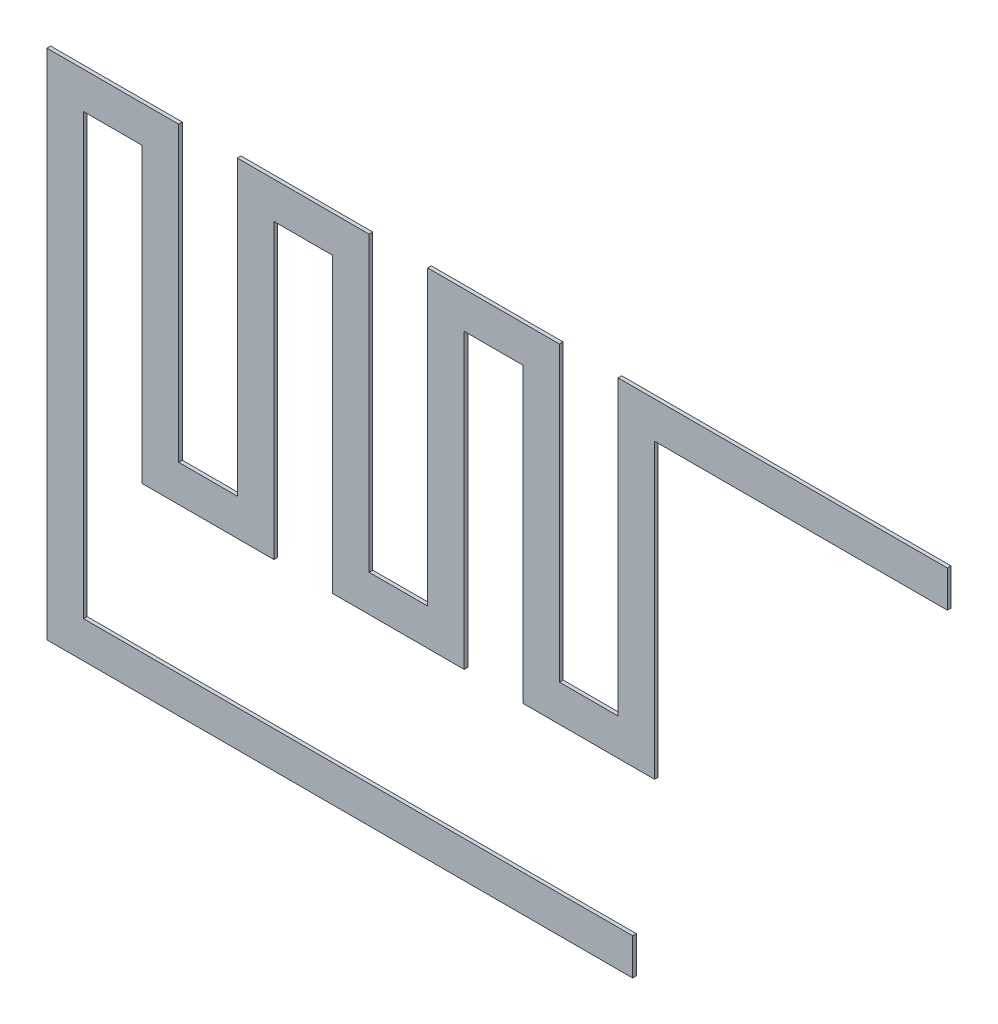
ISO-10303-21;
HEADER;
FILE_DESCRIPTION(('STEP AP214'),'2;1');
FILE_NAME('part.step','',(''),(''),'','','');
FILE_SCHEMA(('AUTOMOTIVE_DESIGN { 1 0 10303 214 1 1 1 1 }'));
ENDSEC;
DATA;
#1=APPLICATION_CONTEXT('core data for automotive mechanical design processes');
#2=APPLICATION_PROTOCOL_DEFINITION('international standard','automotive_design',2000,#1);
#3=PRODUCT_CONTEXT('',#1,'mechanical');
#4=PRODUCT('Part','Part','',(#3));
#5=PRODUCT_RELATED_PRODUCT_CATEGORY('part','',(#4));
#6=PRODUCT_DEFINITION_FORMATION('','',#4);
#7=PRODUCT_DEFINITION_CONTEXT('part definition',#1,'design');
#8=PRODUCT_DEFINITION('design','',#6,#7);
#9=PRODUCT_DEFINITION_SHAPE('','',#8);
#10=(LENGTH_UNIT() NAMED_UNIT(*) SI_UNIT(.MILLI.,.METRE.));
#11=(NAMED_UNIT(*) PLANE_ANGLE_UNIT() SI_UNIT($,.RADIAN.));
#12=(NAMED_UNIT(*) SI_UNIT($,.STERADIAN.) SOLID_ANGLE_UNIT());
#13=UNCERTAINTY_MEASURE_WITH_UNIT(LENGTH_MEASURE(1.E-05),#10,'distance_accuracy_value','');
#14=(GEOMETRIC_REPRESENTATION_CONTEXT(3) GLOBAL_UNCERTAINTY_ASSIGNED_CONTEXT((#13)) GLOBAL_UNIT_ASSIGNED_CONTEXT((#10,
#11,#12)) REPRESENTATION_CONTEXT('',''));
#15=CARTESIAN_POINT('',(0.,0.,0.));
#16=DIRECTION('',(0.,0.,1.));
#17=DIRECTION('',(1.,0.,0.));
#18=AXIS2_PLACEMENT_3D('',#15,#16,#17);
#19=CARTESIAN_POINT('',(4.513681102362,4.058562992126,0.025));
#20=DIRECTION('',(0.,0.,1.));
#21=DIRECTION('',(1.,0.,0.));
#22=AXIS2_PLACEMENT_3D('',#19,#20,#21);
#23=PLANE('',#22);
#24=DIRECTION('',(1.,0.,0.));
#25=VECTOR('',#24,1.);
#26=CARTESIAN_POINT('',(2.6,3.,0.025));
#27=LINE('',#26,#25);
#28=CARTESIAN_POINT('',(1.8,3.,0.025));
#29=VERTEX_POINT('',#28);
#30=CARTESIAN_POINT('',(2.6,3.,0.025));
#31=VERTEX_POINT('',#30);
#32=EDGE_CURVE('E525',#29,#31,#27,.T.);
#33=ORIENTED_EDGE('',*,*,#32,.F.);
#34=DIRECTION('',(0.,-1.,0.));
#35=VECTOR('',#34,1.);
#36=CARTESIAN_POINT('',(1.8,3.,0.025));
#37=LINE('',#36,#35);
#38=CARTESIAN_POINT('',(1.8,7.,0.025));
#39=VERTEX_POINT('',#38);
#40=EDGE_CURVE('E254',#39,#29,#37,.T.);
#41=ORIENTED_EDGE('',*,*,#40,.F.);
#42=DIRECTION('',(1.,0.,0.));
#43=VECTOR('',#42,1.);
#44=CARTESIAN_POINT('',(1.8,7.,0.025));
#45=LINE('',#44,#43);
#46=CARTESIAN_POINT('',(0.,7.,0.025));
#47=VERTEX_POINT('',#46);
#48=EDGE_CURVE('E188',#47,#39,#45,.T.);
#49=ORIENTED_EDGE('',*,*,#48,.F.);
#50=DIRECTION('',(0.,1.,0.));
#51=VECTOR('',#50,1.);
#52=CARTESIAN_POINT('',(0.,7.,0.025));
#53=LINE('',#52,#51);
#54=CARTESIAN_POINT('',(0.,0.,0.025));
#55=VERTEX_POINT('',#54);
#56=EDGE_CURVE('E185',#55,#47,#53,.T.);
#57=ORIENTED_EDGE('',*,*,#56,.F.);
#58=DIRECTION('',(-1.,0.,0.));
#59=VECTOR('',#58,1.);
#60=CARTESIAN_POINT('',(0.,0.,0.025));
#61=LINE('',#60,#59);
#62=CARTESIAN_POINT('',(8.,0.,0.025));
#63=VERTEX_POINT('',#62);
#64=EDGE_CURVE('E171',#63,#55,#61,.T.);
#65=ORIENTED_EDGE('',*,*,#64,.F.);
#66=DIRECTION('',(0.,-1.,0.));
#67=VECTOR('',#66,1.);
#68=CARTESIAN_POINT('',(8.,0.,0.025));
#69=LINE('',#68,#67);
#70=CARTESIAN_POINT('',(8.,0.5,0.025));
#71=VERTEX_POINT('',#70);
#72=EDGE_CURVE('E28',#71,#63,#69,.T.);
#73=ORIENTED_EDGE('',*,*,#72,.F.);
#74=DIRECTION('',(1.,0.,0.));
#75=VECTOR('',#74,1.);
#76=CARTESIAN_POINT('',(8.,0.5,0.025));
#77=LINE('',#76,#75);
#78=CARTESIAN_POINT('',(0.5,0.5,0.025));
#79=VERTEX_POINT('',#78);
#80=EDGE_CURVE('E11',#79,#71,#77,.T.);
#81=ORIENTED_EDGE('',*,*,#80,.F.);
#82=DIRECTION('',(0.,-1.,0.));
#83=VECTOR('',#82,1.);
#84=CARTESIAN_POINT('',(0.5,0.5,0.025));
#85=LINE('',#84,#83);
#86=CARTESIAN_POINT('',(0.5,6.5,0.025));
#87=VERTEX_POINT('',#86);
#88=EDGE_CURVE('E526',#87,#79,#85,.T.);
#89=ORIENTED_EDGE('',*,*,#88,.F.);
#90=DIRECTION('',(-1.,0.,0.));
#91=VECTOR('',#90,1.);
#92=CARTESIAN_POINT('',(0.5,6.5,0.025));
#93=LINE('',#92,#91);
#94=CARTESIAN_POINT('',(1.3,6.5,0.025));
#95=VERTEX_POINT('',#94);
#96=EDGE_CURVE('E535',#95,#87,#93,.T.);
#97=ORIENTED_EDGE('',*,*,#96,.F.);
#98=DIRECTION('',(0.,1.,0.));
#99=VECTOR('',#98,1.);
#100=CARTESIAN_POINT('',(1.3,6.5,0.025));
#101=LINE('',#100,#99);
#102=CARTESIAN_POINT('',(1.3,2.5,0.025));
#103=VERTEX_POINT('',#102);
#104=EDGE_CURVE('E493',#103,#95,#101,.T.);
#105=ORIENTED_EDGE('',*,*,#104,.F.);
#106=DIRECTION('',(-1.,0.,0.));
#107=VECTOR('',#106,1.);
#108=CARTESIAN_POINT('',(1.3,2.5,0.025));
#109=LINE('',#108,#107);
#110=CARTESIAN_POINT('',(3.1,2.5,0.025));
#111=VERTEX_POINT('',#110);
#112=EDGE_CURVE('E492',#111,#103,#109,.T.);
#113=ORIENTED_EDGE('',*,*,#112,.F.);
#114=DIRECTION('',(0.,-1.,0.));
#115=VECTOR('',#114,1.);
#116=CARTESIAN_POINT('',(3.1,2.5,0.025));
#117=LINE('',#116,#115);
#118=CARTESIAN_POINT('',(3.1,6.5,0.025));
#119=VERTEX_POINT('',#118);
#120=EDGE_CURVE('E458',#119,#111,#117,.T.);
#121=ORIENTED_EDGE('',*,*,#120,.F.);
#122=DIRECTION('',(-1.,0.,0.));
#123=VECTOR('',#122,1.);
#124=CARTESIAN_POINT('',(3.1,6.5,0.025));
#125=LINE('',#124,#123);
#126=CARTESIAN_POINT('',(3.9,6.5,0.025));
#127=VERTEX_POINT('',#126);
#128=EDGE_CURVE('E549',#127,#119,#125,.T.);
#129=ORIENTED_EDGE('',*,*,#128,.F.);
#130=DIRECTION('',(0.,1.,0.));
#131=VECTOR('',#130,1.);
#132=CARTESIAN_POINT('',(3.9,6.5,0.025));
#133=LINE('',#132,#131);
#134=CARTESIAN_POINT('',(3.9,2.5,0.025));
#135=VERTEX_POINT('',#134);
#136=EDGE_CURVE('E498',#135,#127,#133,.T.);
#137=ORIENTED_EDGE('',*,*,#136,.F.);
#138=DIRECTION('',(-1.,0.,0.));
#139=VECTOR('',#138,1.);
#140=CARTESIAN_POINT('',(3.9,2.5,0.025));
#141=LINE('',#140,#139);
#142=CARTESIAN_POINT('',(5.7,2.5,0.025));
#143=VERTEX_POINT('',#142);
#144=EDGE_CURVE('E555',#143,#135,#141,.T.);
#145=ORIENTED_EDGE('',*,*,#144,.F.);
#146=DIRECTION('',(0.,-1.,0.));
#147=VECTOR('',#146,1.);
#148=CARTESIAN_POINT('',(5.7,2.5,0.025));
#149=LINE('',#148,#147);
#150=CARTESIAN_POINT('',(5.7,6.5,0.025));
#151=VERTEX_POINT('',#150);
#152=EDGE_CURVE('E560',#151,#143,#149,.T.);
#153=ORIENTED_EDGE('',*,*,#152,.F.);
#154=DIRECTION('',(-1.,0.,0.));
#155=VECTOR('',#154,1.);
#156=CARTESIAN_POINT('',(5.7,6.5,0.025));
#157=LINE('',#156,#155);
#158=CARTESIAN_POINT('',(6.5,6.5,0.025));
#159=VERTEX_POINT('',#158);
#160=EDGE_CURVE('E568',#159,#151,#157,.T.);
#161=ORIENTED_EDGE('',*,*,#160,.F.);
#162=DIRECTION('',(0.,1.,0.));
#163=VECTOR('',#162,1.);
#164=CARTESIAN_POINT('',(6.5,6.5,0.025));
#165=LINE('',#164,#163);
#166=CARTESIAN_POINT('',(6.5,2.5,0.025));
#167=VERTEX_POINT('',#166);
#168=EDGE_CURVE('E424',#167,#159,#165,.T.);
#169=ORIENTED_EDGE('',*,*,#168,.F.);
#170=DIRECTION('',(-1.,0.,0.));
#171=VECTOR('',#170,1.);
#172=CARTESIAN_POINT('',(6.5,2.5,0.025));
#173=LINE('',#172,#171);
#174=CARTESIAN_POINT('',(8.3,2.5,0.025));
#175=VERTEX_POINT('',#174);
#176=EDGE_CURVE('E430',#175,#167,#173,.T.);
#177=ORIENTED_EDGE('',*,*,#176,.F.);
#178=DIRECTION('',(0.,-1.,0.));
#179=VECTOR('',#178,1.);
#180=CARTESIAN_POINT('',(8.3,2.5,0.025));
#181=LINE('',#180,#179);
#182=CARTESIAN_POINT('',(8.3,6.5,0.025));
#183=VERTEX_POINT('',#182);
#184=EDGE_CURVE('E429',#183,#175,#181,.T.);
#185=ORIENTED_EDGE('',*,*,#184,.F.);
#186=DIRECTION('',(-1.,0.,0.));
#187=VECTOR('',#186,1.);
#188=CARTESIAN_POINT('',(8.3,6.5,0.025));
#189=LINE('',#188,#187);
#190=CARTESIAN_POINT('',(12.3,6.5,0.025));
#191=VERTEX_POINT('',#190);
#192=EDGE_CURVE('E383',#191,#183,#189,.T.);
#193=ORIENTED_EDGE('',*,*,#192,.F.);
#194=DIRECTION('',(0.,-1.,0.));
#195=VECTOR('',#194,1.);
#196=CARTESIAN_POINT('',(12.3,6.5,0.025));
#197=LINE('',#196,#195);
#198=CARTESIAN_POINT('',(12.3,7.,0.025));
#199=VERTEX_POINT('',#198);
#200=EDGE_CURVE('E381',#199,#191,#197,.T.);
#201=ORIENTED_EDGE('',*,*,#200,.F.);
#202=DIRECTION('',(1.,0.,0.));
#203=VECTOR('',#202,1.);
#204=CARTESIAN_POINT('',(12.3,7.,0.025));
#205=LINE('',#204,#203);
#206=CARTESIAN_POINT('',(7.8,7.,0.025));
#207=VERTEX_POINT('',#206);
#208=EDGE_CURVE('E368',#207,#199,#205,.T.);
#209=ORIENTED_EDGE('',*,*,#208,.F.);
#210=DIRECTION('',(0.,1.,0.));
#211=VECTOR('',#210,1.);
#212=CARTESIAN_POINT('',(7.8,7.,0.025));
#213=LINE('',#212,#211);
#214=CARTESIAN_POINT('',(7.8,3.,0.025));
#215=VERTEX_POINT('',#214);
#216=EDGE_CURVE('E403',#215,#207,#213,.T.);
#217=ORIENTED_EDGE('',*,*,#216,.F.);
#218=DIRECTION('',(1.,0.,0.));
#219=VECTOR('',#218,1.);
#220=CARTESIAN_POINT('',(7.8,3.,0.025));
#221=LINE('',#220,#219);
#222=CARTESIAN_POINT('',(7.,3.,0.025));
#223=VERTEX_POINT('',#222);
#224=EDGE_CURVE('E221',#223,#215,#221,.T.);
#225=ORIENTED_EDGE('',*,*,#224,.F.);
#226=DIRECTION('',(0.,-1.,0.));
#227=VECTOR('',#226,1.);
#228=CARTESIAN_POINT('',(7.,3.,0.025));
#229=LINE('',#228,#227);
#230=CARTESIAN_POINT('',(7.,7.,0.025));
#231=VERTEX_POINT('',#230);
#232=EDGE_CURVE('E228',#231,#223,#229,.T.);
#233=ORIENTED_EDGE('',*,*,#232,.F.);
#234=DIRECTION('',(1.,0.,0.));
#235=VECTOR('',#234,1.);
#236=CARTESIAN_POINT('',(7.,7.,0.025));
#237=LINE('',#236,#235);
#238=CARTESIAN_POINT('',(5.2,7.,0.025));
#239=VERTEX_POINT('',#238);
#240=EDGE_CURVE('E235',#239,#231,#237,.T.);
#241=ORIENTED_EDGE('',*,*,#240,.F.);
#242=DIRECTION('',(0.,1.,0.));
#243=VECTOR('',#242,1.);
#244=CARTESIAN_POINT('',(5.2,7.,0.025));
#245=LINE('',#244,#243);
#246=CARTESIAN_POINT('',(5.2,3.,0.025));
#247=VERTEX_POINT('',#246);
#248=EDGE_CURVE('E241',#247,#239,#245,.T.);
#249=ORIENTED_EDGE('',*,*,#248,.F.);
#250=DIRECTION('',(1.,0.,0.));
#251=VECTOR('',#250,1.);
#252=CARTESIAN_POINT('',(5.2,3.,0.025));
#253=LINE('',#252,#251);
#254=CARTESIAN_POINT('',(4.4,3.,0.025));
#255=VERTEX_POINT('',#254);
#256=EDGE_CURVE('E240',#255,#247,#253,.T.);
#257=ORIENTED_EDGE('',*,*,#256,.F.);
#258=DIRECTION('',(0.,-1.,0.));
#259=VECTOR('',#258,1.);
#260=CARTESIAN_POINT('',(4.4,3.,0.025));
#261=LINE('',#260,#259);
#262=CARTESIAN_POINT('',(4.4,7.,0.025));
#263=VERTEX_POINT('',#262);
#264=EDGE_CURVE('E248',#263,#255,#261,.T.);
#265=ORIENTED_EDGE('',*,*,#264,.F.);
#266=DIRECTION('',(1.,0.,0.));
#267=VECTOR('',#266,1.);
#268=CARTESIAN_POINT('',(4.4,7.,0.025));
#269=LINE('',#268,#267);
#270=CARTESIAN_POINT('',(2.6,7.,0.025));
#271=VERTEX_POINT('',#270);
#272=EDGE_CURVE('E408',#271,#263,#269,.T.);
#273=ORIENTED_EDGE('',*,*,#272,.F.);
#274=DIRECTION('',(0.,1.,0.));
#275=VECTOR('',#274,1.);
#276=CARTESIAN_POINT('',(2.6,7.,0.025));
#277=LINE('',#276,#275);
#278=EDGE_CURVE('E249',#31,#271,#277,.T.);
#279=ORIENTED_EDGE('',*,*,#278,.F.);
#280=EDGE_LOOP('',(#33,#41,#49,#57,#65,#73,#81,#89,#97,#105,#113,#121,#129,#137,#145,#153,#161,
#169,#177,#185,#193,#201,#209,#217,#225,#233,#241,#249,#257,#265,#273,#279));
#281=FACE_BOUND('',#280,.T.);
#282=ADVANCED_FACE('F17',(#281),#23,.T.);
#283=CARTESIAN_POINT('',(8.,0.5,0.));
#284=DIRECTION('',(0.,1.,0.));
#285=DIRECTION('',(1.,0.,0.));
#286=AXIS2_PLACEMENT_3D('',#283,#284,#285);
#287=PLANE('',#286);
#288=DIRECTION('',(0.,0.,-1.));
#289=VECTOR('',#288,1.);
#290=CARTESIAN_POINT('',(0.5,0.5,0.));
#291=LINE('',#290,#289);
#292=CARTESIAN_POINT('',(0.5,0.5,-0.025));
#293=VERTEX_POINT('',#292);
#294=EDGE_CURVE('E530',#79,#293,#291,.T.);
#295=ORIENTED_EDGE('',*,*,#294,.F.);
#296=ORIENTED_EDGE('',*,*,#80,.T.);
#297=DIRECTION('',(0.,0.,1.));
#298=VECTOR('',#297,1.);
#299=CARTESIAN_POINT('',(8.,0.5,0.));
#300=LINE('',#299,#298);
#301=CARTESIAN_POINT('',(8.,0.5,-0.025));
#302=VERTEX_POINT('',#301);
#303=EDGE_CURVE('E182',#302,#71,#300,.T.);
#304=ORIENTED_EDGE('',*,*,#303,.F.);
#305=DIRECTION('',(1.,0.,0.));
#306=VECTOR('',#305,1.);
#307=CARTESIAN_POINT('',(4.513681102362,0.5,-0.025));
#308=LINE('',#307,#306);
#309=EDGE_CURVE('E681',#293,#302,#308,.T.);
#310=ORIENTED_EDGE('',*,*,#309,.F.);
#311=EDGE_LOOP('',(#295,#296,#304,#310));
#312=FACE_BOUND('',#311,.T.);
#313=ADVANCED_FACE('F19',(#312),#287,.T.);
#314=CARTESIAN_POINT('',(8.,0.,0.));
#315=DIRECTION('',(1.,0.,0.));
#316=DIRECTION('',(0.,-1.,0.));
#317=AXIS2_PLACEMENT_3D('',#314,#315,#316);
#318=PLANE('',#317);
#319=ORIENTED_EDGE('',*,*,#303,.T.);
#320=ORIENTED_EDGE('',*,*,#72,.T.);
#321=DIRECTION('',(0.,0.,1.));
#322=VECTOR('',#321,1.);
#323=CARTESIAN_POINT('',(8.,0.,0.));
#324=LINE('',#323,#322);
#325=CARTESIAN_POINT('',(8.,0.,-0.025));
#326=VERTEX_POINT('',#325);
#327=EDGE_CURVE('E21',#326,#63,#324,.T.);
#328=ORIENTED_EDGE('',*,*,#327,.F.);
#329=DIRECTION('',(0.,-1.,0.));
#330=VECTOR('',#329,1.);
#331=CARTESIAN_POINT('',(8.,4.058562992126,-0.025));
#332=LINE('',#331,#330);
#333=EDGE_CURVE('E676',#302,#326,#332,.T.);
#334=ORIENTED_EDGE('',*,*,#333,.F.);
#335=EDGE_LOOP('',(#319,#320,#328,#334));
#336=FACE_BOUND('',#335,.T.);
#337=ADVANCED_FACE('F774',(#336),#318,.T.);
#338=CARTESIAN_POINT('',(0.,0.,0.));
#339=DIRECTION('',(0.,-1.,0.));
#340=DIRECTION('',(0.,0.,-1.));
#341=AXIS2_PLACEMENT_3D('',#338,#339,#340);
#342=PLANE('',#341);
#343=ORIENTED_EDGE('',*,*,#327,.T.);
#344=ORIENTED_EDGE('',*,*,#64,.T.);
#345=DIRECTION('',(0.,0.,1.));
#346=VECTOR('',#345,1.);
#347=CARTESIAN_POINT('',(0.,0.,0.));
#348=LINE('',#347,#346);
#349=CARTESIAN_POINT('',(0.,0.,-0.025));
#350=VERTEX_POINT('',#349);
#351=EDGE_CURVE('E177',#350,#55,#348,.T.);
#352=ORIENTED_EDGE('',*,*,#351,.F.);
#353=DIRECTION('',(-1.,0.,0.));
#354=VECTOR('',#353,1.);
#355=CARTESIAN_POINT('',(4.513681102362,0.,-0.025));
#356=LINE('',#355,#354);
#357=EDGE_CURVE('E680',#326,#350,#356,.T.);
#358=ORIENTED_EDGE('',*,*,#357,.F.);
#359=EDGE_LOOP('',(#343,#344,#352,#358));
#360=FACE_BOUND('',#359,.T.);
#361=ADVANCED_FACE('F173',(#360),#342,.T.);
#362=CARTESIAN_POINT('',(0.,7.,0.));
#363=DIRECTION('',(-1.,0.,0.));
#364=DIRECTION('',(0.,0.,1.));
#365=AXIS2_PLACEMENT_3D('',#362,#363,#364);
#366=PLANE('',#365);
#367=ORIENTED_EDGE('',*,*,#351,.T.);
#368=ORIENTED_EDGE('',*,*,#56,.T.);
#369=DIRECTION('',(0.,0.,1.));
#370=VECTOR('',#369,1.);
#371=CARTESIAN_POINT('',(0.,7.,0.));
#372=LINE('',#371,#370);
#373=CARTESIAN_POINT('',(0.,7.,-0.025));
#374=VERTEX_POINT('',#373);
#375=EDGE_CURVE('E203',#374,#47,#372,.T.);
#376=ORIENTED_EDGE('',*,*,#375,.F.);
#377=DIRECTION('',(0.,1.,0.));
#378=VECTOR('',#377,1.);
#379=CARTESIAN_POINT('',(0.,4.058562992126,-0.025));
#380=LINE('',#379,#378);
#381=EDGE_CURVE('E195',#350,#374,#380,.T.);
#382=ORIENTED_EDGE('',*,*,#381,.F.);
#383=EDGE_LOOP('',(#367,#368,#376,#382));
#384=FACE_BOUND('',#383,.T.);
#385=ADVANCED_FACE('F193',(#384),#366,.T.);
#386=CARTESIAN_POINT('',(1.8,7.,0.));
#387=DIRECTION('',(0.,1.,0.));
#388=DIRECTION('',(1.,0.,0.));
#389=AXIS2_PLACEMENT_3D('',#386,#387,#388);
#390=PLANE('',#389);
#391=ORIENTED_EDGE('',*,*,#375,.T.);
#392=ORIENTED_EDGE('',*,*,#48,.T.);
#393=DIRECTION('',(0.,0.,1.));
#394=VECTOR('',#393,1.);
#395=CARTESIAN_POINT('',(1.8,7.,0.));
#396=LINE('',#395,#394);
#397=CARTESIAN_POINT('',(1.8,7.,-0.025));
#398=VERTEX_POINT('',#397);
#399=EDGE_CURVE('E256',#398,#39,#396,.T.);
#400=ORIENTED_EDGE('',*,*,#399,.F.);
#401=DIRECTION('',(1.,0.,0.));
#402=VECTOR('',#401,1.);
#403=CARTESIAN_POINT('',(4.513681102362,7.,-0.025));
#404=LINE('',#403,#402);
#405=EDGE_CURVE('E266',#374,#398,#404,.T.);
#406=ORIENTED_EDGE('',*,*,#405,.F.);
#407=EDGE_LOOP('',(#391,#392,#400,#406));
#408=FACE_BOUND('',#407,.T.);
#409=ADVANCED_FACE('F262',(#408),#390,.T.);
#410=CARTESIAN_POINT('',(1.8,3.,0.));
#411=DIRECTION('',(1.,0.,0.));
#412=DIRECTION('',(0.,-1.,0.));
#413=AXIS2_PLACEMENT_3D('',#410,#411,#412);
#414=PLANE('',#413);
#415=ORIENTED_EDGE('',*,*,#399,.T.);
#416=ORIENTED_EDGE('',*,*,#40,.T.);
#417=DIRECTION('',(0.,0.,1.));
#418=VECTOR('',#417,1.);
#419=CARTESIAN_POINT('',(1.8,3.,0.));
#420=LINE('',#419,#418);
#421=CARTESIAN_POINT('',(1.8,3.,-0.025));
#422=VERTEX_POINT('',#421);
#423=EDGE_CURVE('E252',#422,#29,#420,.T.);
#424=ORIENTED_EDGE('',*,*,#423,.F.);
#425=DIRECTION('',(0.,-1.,0.));
#426=VECTOR('',#425,1.);
#427=CARTESIAN_POINT('',(1.8,4.058562992126,-0.025));
#428=LINE('',#427,#426);
#429=EDGE_CURVE('E693',#398,#422,#428,.T.);
#430=ORIENTED_EDGE('',*,*,#429,.F.);
#431=EDGE_LOOP('',(#415,#416,#424,#430));
#432=FACE_BOUND('',#431,.T.);
#433=ADVANCED_FACE('F802',(#432),#414,.T.);
#434=CARTESIAN_POINT('',(2.6,3.,0.));
#435=DIRECTION('',(0.,1.,0.));
#436=DIRECTION('',(1.,0.,0.));
#437=AXIS2_PLACEMENT_3D('',#434,#435,#436);
#438=PLANE('',#437);
#439=ORIENTED_EDGE('',*,*,#423,.T.);
#440=ORIENTED_EDGE('',*,*,#32,.T.);
#441=DIRECTION('',(0.,0.,1.));
#442=VECTOR('',#441,1.);
#443=CARTESIAN_POINT('',(2.6,3.,0.));
#444=LINE('',#443,#442);
#445=CARTESIAN_POINT('',(2.6,3.,-0.025));
#446=VERTEX_POINT('',#445);
#447=EDGE_CURVE('E253',#446,#31,#444,.T.);
#448=ORIENTED_EDGE('',*,*,#447,.F.);
#449=DIRECTION('',(1.,0.,0.));
#450=VECTOR('',#449,1.);
#451=CARTESIAN_POINT('',(4.513681102362,3.,-0.025));
#452=LINE('',#451,#450);
#453=EDGE_CURVE('E701',#422,#446,#452,.T.);
#454=ORIENTED_EDGE('',*,*,#453,.F.);
#455=EDGE_LOOP('',(#439,#440,#448,#454));
#456=FACE_BOUND('',#455,.T.);
#457=ADVANCED_FACE('F725',(#456),#438,.T.);
#458=CARTESIAN_POINT('',(2.6,7.,0.));
#459=DIRECTION('',(-1.,0.,0.));
#460=DIRECTION('',(0.,0.,1.));
#461=AXIS2_PLACEMENT_3D('',#458,#459,#460);
#462=PLANE('',#461);
#463=ORIENTED_EDGE('',*,*,#447,.T.);
#464=ORIENTED_EDGE('',*,*,#278,.T.);
#465=DIRECTION('',(0.,0.,1.));
#466=VECTOR('',#465,1.);
#467=CARTESIAN_POINT('',(2.6,7.,0.));
#468=LINE('',#467,#466);
#469=CARTESIAN_POINT('',(2.6,7.,-0.025));
#470=VERTEX_POINT('',#469);
#471=EDGE_CURVE('E405',#470,#271,#468,.T.);
#472=ORIENTED_EDGE('',*,*,#471,.F.);
#473=DIRECTION('',(0.,1.,0.));
#474=VECTOR('',#473,1.);
#475=CARTESIAN_POINT('',(2.6,4.058562992126,-0.025));
#476=LINE('',#475,#474);
#477=EDGE_CURVE('E687',#446,#470,#476,.T.);
#478=ORIENTED_EDGE('',*,*,#477,.F.);
#479=EDGE_LOOP('',(#463,#464,#472,#478));
#480=FACE_BOUND('',#479,.T.);
#481=ADVANCED_FACE('F719',(#480),#462,.T.);
#482=CARTESIAN_POINT('',(4.4,7.,0.));
#483=DIRECTION('',(0.,1.,0.));
#484=DIRECTION('',(1.,0.,0.));
#485=AXIS2_PLACEMENT_3D('',#482,#483,#484);
#486=PLANE('',#485);
#487=ORIENTED_EDGE('',*,*,#471,.T.);
#488=ORIENTED_EDGE('',*,*,#272,.T.);
#489=DIRECTION('',(0.,0.,1.));
#490=VECTOR('',#489,1.);
#491=CARTESIAN_POINT('',(4.4,7.,0.));
#492=LINE('',#491,#490);
#493=CARTESIAN_POINT('',(4.4,7.,-0.025));
#494=VERTEX_POINT('',#493);
#495=EDGE_CURVE('E244',#494,#263,#492,.T.);
#496=ORIENTED_EDGE('',*,*,#495,.F.);
#497=DIRECTION('',(1.,0.,0.));
#498=VECTOR('',#497,1.);
#499=CARTESIAN_POINT('',(4.513681102362,7.,-0.025));
#500=LINE('',#499,#498);
#501=EDGE_CURVE('E682',#470,#494,#500,.T.);
#502=ORIENTED_EDGE('',*,*,#501,.F.);
#503=EDGE_LOOP('',(#487,#488,#496,#502));
#504=FACE_BOUND('',#503,.T.);
#505=ADVANCED_FACE('F728',(#504),#486,.T.);
#506=CARTESIAN_POINT('',(4.4,3.,0.));
#507=DIRECTION('',(1.,0.,0.));
#508=DIRECTION('',(0.,-1.,0.));
#509=AXIS2_PLACEMENT_3D('',#506,#507,#508);
#510=PLANE('',#509);
#511=ORIENTED_EDGE('',*,*,#495,.T.);
#512=ORIENTED_EDGE('',*,*,#264,.T.);
#513=DIRECTION('',(0.,0.,1.));
#514=VECTOR('',#513,1.);
#515=CARTESIAN_POINT('',(4.4,3.,0.));
#516=LINE('',#515,#514);
#517=CARTESIAN_POINT('',(4.4,3.,-0.025));
#518=VERTEX_POINT('',#517);
#519=EDGE_CURVE('E236',#518,#255,#516,.T.);
#520=ORIENTED_EDGE('',*,*,#519,.F.);
#521=DIRECTION('',(0.,-1.,0.));
#522=VECTOR('',#521,1.);
#523=CARTESIAN_POINT('',(4.4,4.058562992126,-0.025));
#524=LINE('',#523,#522);
#525=EDGE_CURVE('E686',#494,#518,#524,.T.);
#526=ORIENTED_EDGE('',*,*,#525,.F.);
#527=EDGE_LOOP('',(#511,#512,#520,#526));
#528=FACE_BOUND('',#527,.T.);
#529=ADVANCED_FACE('F730',(#528),#510,.T.);
#530=CARTESIAN_POINT('',(5.2,3.,0.));
#531=DIRECTION('',(0.,1.,0.));
#532=DIRECTION('',(1.,0.,0.));
#533=AXIS2_PLACEMENT_3D('',#530,#531,#532);
#534=PLANE('',#533);
#535=ORIENTED_EDGE('',*,*,#519,.T.);
#536=ORIENTED_EDGE('',*,*,#256,.T.);
#537=DIRECTION('',(0.,0.,1.));
#538=VECTOR('',#537,1.);
#539=CARTESIAN_POINT('',(5.2,3.,0.));
#540=LINE('',#539,#538);
#541=CARTESIAN_POINT('',(5.2,3.,-0.025));
#542=VERTEX_POINT('',#541);
#543=EDGE_CURVE('E481',#542,#247,#540,.T.);
#544=ORIENTED_EDGE('',*,*,#543,.F.);
#545=DIRECTION('',(1.,0.,0.));
#546=VECTOR('',#545,1.);
#547=CARTESIAN_POINT('',(4.513681102362,3.,-0.025));
#548=LINE('',#547,#546);
#549=EDGE_CURVE('E592',#518,#542,#548,.T.);
#550=ORIENTED_EDGE('',*,*,#549,.F.);
#551=EDGE_LOOP('',(#535,#536,#544,#550));
#552=FACE_BOUND('',#551,.T.);
#553=ADVANCED_FACE('F816',(#552),#534,.T.);
#554=CARTESIAN_POINT('',(5.2,7.,0.));
#555=DIRECTION('',(-1.,0.,0.));
#556=DIRECTION('',(0.,0.,1.));
#557=AXIS2_PLACEMENT_3D('',#554,#555,#556);
#558=PLANE('',#557);
#559=ORIENTED_EDGE('',*,*,#543,.T.);
#560=ORIENTED_EDGE('',*,*,#248,.T.);
#561=DIRECTION('',(0.,0.,1.));
#562=VECTOR('',#561,1.);
#563=CARTESIAN_POINT('',(5.2,7.,0.));
#564=LINE('',#563,#562);
#565=CARTESIAN_POINT('',(5.2,7.,-0.025));
#566=VERTEX_POINT('',#565);
#567=EDGE_CURVE('E231',#566,#239,#564,.T.);
#568=ORIENTED_EDGE('',*,*,#567,.F.);
#569=DIRECTION('',(0.,1.,0.));
#570=VECTOR('',#569,1.);
#571=CARTESIAN_POINT('',(5.2,4.058562992126,-0.025));
#572=LINE('',#571,#570);
#573=EDGE_CURVE('E587',#542,#566,#572,.T.);
#574=ORIENTED_EDGE('',*,*,#573,.F.);
#575=EDGE_LOOP('',(#559,#560,#568,#574));
#576=FACE_BOUND('',#575,.T.);
#577=ADVANCED_FACE('F821',(#576),#558,.T.);
#578=CARTESIAN_POINT('',(7.,7.,0.));
#579=DIRECTION('',(0.,1.,0.));
#580=DIRECTION('',(1.,0.,0.));
#581=AXIS2_PLACEMENT_3D('',#578,#579,#580);
#582=PLANE('',#581);
#583=ORIENTED_EDGE('',*,*,#567,.T.);
#584=ORIENTED_EDGE('',*,*,#240,.T.);
#585=DIRECTION('',(0.,0.,1.));
#586=VECTOR('',#585,1.);
#587=CARTESIAN_POINT('',(7.,7.,0.));
#588=LINE('',#587,#586);
#589=CARTESIAN_POINT('',(7.,7.,-0.025));
#590=VERTEX_POINT('',#589);
#591=EDGE_CURVE('E224',#590,#231,#588,.T.);
#592=ORIENTED_EDGE('',*,*,#591,.F.);
#593=DIRECTION('',(1.,0.,0.));
#594=VECTOR('',#593,1.);
#595=CARTESIAN_POINT('',(4.513681102362,7.,-0.025));
#596=LINE('',#595,#594);
#597=EDGE_CURVE('E591',#566,#590,#596,.T.);
#598=ORIENTED_EDGE('',*,*,#597,.F.);
#599=EDGE_LOOP('',(#583,#584,#592,#598));
#600=FACE_BOUND('',#599,.T.);
#601=ADVANCED_FACE('F830',(#600),#582,.T.);
#602=CARTESIAN_POINT('',(7.,3.,0.));
#603=DIRECTION('',(1.,0.,0.));
#604=DIRECTION('',(0.,-1.,0.));
#605=AXIS2_PLACEMENT_3D('',#602,#603,#604);
#606=PLANE('',#605);
#607=ORIENTED_EDGE('',*,*,#591,.T.);
#608=ORIENTED_EDGE('',*,*,#232,.T.);
#609=DIRECTION('',(0.,0.,1.));
#610=VECTOR('',#609,1.);
#611=CARTESIAN_POINT('',(7.,3.,0.));
#612=LINE('',#611,#610);
#613=CARTESIAN_POINT('',(7.,3.,-0.025));
#614=VERTEX_POINT('',#613);
#615=EDGE_CURVE('E219',#614,#223,#612,.T.);
#616=ORIENTED_EDGE('',*,*,#615,.F.);
#617=DIRECTION('',(0.,-1.,0.));
#618=VECTOR('',#617,1.);
#619=CARTESIAN_POINT('',(7.,4.058562992126,-0.025));
#620=LINE('',#619,#618);
#621=EDGE_CURVE('E596',#590,#614,#620,.T.);
#622=ORIENTED_EDGE('',*,*,#621,.F.);
#623=EDGE_LOOP('',(#607,#608,#616,#622));
#624=FACE_BOUND('',#623,.T.);
#625=ADVANCED_FACE('F836',(#624),#606,.T.);
#626=CARTESIAN_POINT('',(7.8,3.,0.));
#627=DIRECTION('',(0.,1.,0.));
#628=DIRECTION('',(1.,0.,0.));
#629=AXIS2_PLACEMENT_3D('',#626,#627,#628);
#630=PLANE('',#629);
#631=ORIENTED_EDGE('',*,*,#615,.T.);
#632=ORIENTED_EDGE('',*,*,#224,.T.);
#633=DIRECTION('',(0.,0.,1.));
#634=VECTOR('',#633,1.);
#635=CARTESIAN_POINT('',(7.8,3.,0.));
#636=LINE('',#635,#634);
#637=CARTESIAN_POINT('',(7.8,3.,-0.025));
#638=VERTEX_POINT('',#637);
#639=EDGE_CURVE('E378',#638,#215,#636,.T.);
#640=ORIENTED_EDGE('',*,*,#639,.F.);
#641=DIRECTION('',(1.,0.,0.));
#642=VECTOR('',#641,1.);
#643=CARTESIAN_POINT('',(4.513681102362,3.,-0.025));
#644=LINE('',#643,#642);
#645=EDGE_CURVE('E600',#614,#638,#644,.T.);
#646=ORIENTED_EDGE('',*,*,#645,.F.);
#647=EDGE_LOOP('',(#631,#632,#640,#646));
#648=FACE_BOUND('',#647,.T.);
#649=ADVANCED_FACE('F841',(#648),#630,.T.);
#650=CARTESIAN_POINT('',(7.8,7.,0.));
#651=DIRECTION('',(-1.,0.,0.));
#652=DIRECTION('',(0.,1.,0.));
#653=AXIS2_PLACEMENT_3D('',#650,#651,#652);
#654=PLANE('',#653);
#655=ORIENTED_EDGE('',*,*,#639,.T.);
#656=ORIENTED_EDGE('',*,*,#216,.T.);
#657=DIRECTION('',(0.,0.,1.));
#658=VECTOR('',#657,1.);
#659=CARTESIAN_POINT('',(7.8,7.,0.));
#660=LINE('',#659,#658);
#661=CARTESIAN_POINT('',(7.8,7.,-0.025));
#662=VERTEX_POINT('',#661);
#663=EDGE_CURVE('E375',#662,#207,#660,.T.);
#664=ORIENTED_EDGE('',*,*,#663,.F.);
#665=DIRECTION('',(0.,1.,0.));
#666=VECTOR('',#665,1.);
#667=CARTESIAN_POINT('',(7.8,4.058562992126,-0.025));
#668=LINE('',#667,#666);
#669=EDGE_CURVE('E604',#638,#662,#668,.T.);
#670=ORIENTED_EDGE('',*,*,#669,.F.);
#671=EDGE_LOOP('',(#655,#656,#664,#670));
#672=FACE_BOUND('',#671,.T.);
#673=ADVANCED_FACE('F850',(#672),#654,.T.);
#674=CARTESIAN_POINT('',(12.3,7.,0.));
#675=DIRECTION('',(0.,1.,0.));
#676=DIRECTION('',(1.,0.,0.));
#677=AXIS2_PLACEMENT_3D('',#674,#675,#676);
#678=PLANE('',#677);
#679=ORIENTED_EDGE('',*,*,#663,.T.);
#680=ORIENTED_EDGE('',*,*,#208,.T.);
#681=DIRECTION('',(0.,0.,1.));
#682=VECTOR('',#681,1.);
#683=CARTESIAN_POINT('',(12.3,7.,0.));
#684=LINE('',#683,#682);
#685=CARTESIAN_POINT('',(12.3,7.,-0.025));
#686=VERTEX_POINT('',#685);
#687=EDGE_CURVE('E373',#686,#199,#684,.T.);
#688=ORIENTED_EDGE('',*,*,#687,.F.);
#689=DIRECTION('',(1.,0.,0.));
#690=VECTOR('',#689,1.);
#691=CARTESIAN_POINT('',(4.513681102362,7.,-0.025));
#692=LINE('',#691,#690);
#693=EDGE_CURVE('E607',#662,#686,#692,.T.);
#694=ORIENTED_EDGE('',*,*,#693,.F.);
#695=EDGE_LOOP('',(#679,#680,#688,#694));
#696=FACE_BOUND('',#695,.T.);
#697=ADVANCED_FACE('F370',(#696),#678,.T.);
#698=CARTESIAN_POINT('',(12.3,6.5,0.));
#699=DIRECTION('',(1.,0.,0.));
#700=DIRECTION('',(0.,1.,0.));
#701=AXIS2_PLACEMENT_3D('',#698,#699,#700);
#702=PLANE('',#701);
#703=ORIENTED_EDGE('',*,*,#687,.T.);
#704=ORIENTED_EDGE('',*,*,#200,.T.);
#705=DIRECTION('',(0.,0.,1.));
#706=VECTOR('',#705,1.);
#707=CARTESIAN_POINT('',(12.3,6.5,0.));
#708=LINE('',#707,#706);
#709=CARTESIAN_POINT('',(12.3,6.5,-0.025));
#710=VERTEX_POINT('',#709);
#711=EDGE_CURVE('E397',#710,#191,#708,.T.);
#712=ORIENTED_EDGE('',*,*,#711,.F.);
#713=DIRECTION('',(0.,-1.,0.));
#714=VECTOR('',#713,1.);
#715=CARTESIAN_POINT('',(12.3,4.058562992126,-0.025));
#716=LINE('',#715,#714);
#717=EDGE_CURVE('E390',#686,#710,#716,.T.);
#718=ORIENTED_EDGE('',*,*,#717,.F.);
#719=EDGE_LOOP('',(#703,#704,#712,#718));
#720=FACE_BOUND('',#719,.T.);
#721=ADVANCED_FACE('F388',(#720),#702,.T.);
#722=CARTESIAN_POINT('',(8.3,6.5,0.));
#723=DIRECTION('',(0.,-1.,0.));
#724=DIRECTION('',(-1.,0.,0.));
#725=AXIS2_PLACEMENT_3D('',#722,#723,#724);
#726=PLANE('',#725);
#727=ORIENTED_EDGE('',*,*,#711,.T.);
#728=ORIENTED_EDGE('',*,*,#192,.T.);
#729=DIRECTION('',(0.,0.,1.));
#730=VECTOR('',#729,1.);
#731=CARTESIAN_POINT('',(8.3,6.5,0.));
#732=LINE('',#731,#730);
#733=CARTESIAN_POINT('',(8.3,6.5,-0.025));
#734=VERTEX_POINT('',#733);
#735=EDGE_CURVE('E426',#734,#183,#732,.T.);
#736=ORIENTED_EDGE('',*,*,#735,.F.);
#737=DIRECTION('',(-1.,0.,0.));
#738=VECTOR('',#737,1.);
#739=CARTESIAN_POINT('',(4.513681102362,6.5,-0.025));
#740=LINE('',#739,#738);
#741=EDGE_CURVE('E611',#710,#734,#740,.T.);
#742=ORIENTED_EDGE('',*,*,#741,.F.);
#743=EDGE_LOOP('',(#727,#728,#736,#742));
#744=FACE_BOUND('',#743,.T.);
#745=ADVANCED_FACE('F884',(#744),#726,.T.);
#746=CARTESIAN_POINT('',(8.3,2.5,0.));
#747=DIRECTION('',(1.,0.,0.));
#748=DIRECTION('',(0.,1.,0.));
#749=AXIS2_PLACEMENT_3D('',#746,#747,#748);
#750=PLANE('',#749);
#751=ORIENTED_EDGE('',*,*,#735,.T.);
#752=ORIENTED_EDGE('',*,*,#184,.T.);
#753=DIRECTION('',(0.,0.,1.));
#754=VECTOR('',#753,1.);
#755=CARTESIAN_POINT('',(8.3,2.5,0.));
#756=LINE('',#755,#754);
#757=CARTESIAN_POINT('',(8.3,2.5,-0.025));
#758=VERTEX_POINT('',#757);
#759=EDGE_CURVE('E439',#758,#175,#756,.T.);
#760=ORIENTED_EDGE('',*,*,#759,.F.);
#761=DIRECTION('',(0.,-1.,0.));
#762=VECTOR('',#761,1.);
#763=CARTESIAN_POINT('',(8.3,4.058562992126,-0.025));
#764=LINE('',#763,#762);
#765=EDGE_CURVE('E451',#734,#758,#764,.T.);
#766=ORIENTED_EDGE('',*,*,#765,.F.);
#767=EDGE_LOOP('',(#751,#752,#760,#766));
#768=FACE_BOUND('',#767,.T.);
#769=ADVANCED_FACE('F625',(#768),#750,.T.);
#770=CARTESIAN_POINT('',(6.5,2.5,0.));
#771=DIRECTION('',(0.,-1.,0.));
#772=DIRECTION('',(-1.,0.,0.));
#773=AXIS2_PLACEMENT_3D('',#770,#771,#772);
#774=PLANE('',#773);
#775=ORIENTED_EDGE('',*,*,#759,.T.);
#776=ORIENTED_EDGE('',*,*,#176,.T.);
#777=DIRECTION('',(0.,0.,1.));
#778=VECTOR('',#777,1.);
#779=CARTESIAN_POINT('',(6.5,2.5,0.));
#780=LINE('',#779,#778);
#781=CARTESIAN_POINT('',(6.5,2.5,-0.025));
#782=VERTEX_POINT('',#781);
#783=EDGE_CURVE('E569',#782,#167,#780,.T.);
#784=ORIENTED_EDGE('',*,*,#783,.F.);
#785=DIRECTION('',(-1.,0.,0.));
#786=VECTOR('',#785,1.);
#787=CARTESIAN_POINT('',(4.513681102362,2.5,-0.025));
#788=LINE('',#787,#786);
#789=EDGE_CURVE('E453',#758,#782,#788,.T.);
#790=ORIENTED_EDGE('',*,*,#789,.F.);
#791=EDGE_LOOP('',(#775,#776,#784,#790));
#792=FACE_BOUND('',#791,.T.);
#793=ADVANCED_FACE('F626',(#792),#774,.T.);
#794=CARTESIAN_POINT('',(6.5,6.5,0.));
#795=DIRECTION('',(-1.,0.,0.));
#796=DIRECTION('',(0.,0.,1.));
#797=AXIS2_PLACEMENT_3D('',#794,#795,#796);
#798=PLANE('',#797);
#799=ORIENTED_EDGE('',*,*,#783,.T.);
#800=ORIENTED_EDGE('',*,*,#168,.T.);
#801=DIRECTION('',(0.,0.,1.));
#802=VECTOR('',#801,1.);
#803=CARTESIAN_POINT('',(6.5,6.5,0.));
#804=LINE('',#803,#802);
#805=CARTESIAN_POINT('',(6.5,6.5,-0.025));
#806=VERTEX_POINT('',#805);
#807=EDGE_CURVE('E565',#806,#159,#804,.T.);
#808=ORIENTED_EDGE('',*,*,#807,.F.);
#809=DIRECTION('',(0.,1.,0.));
#810=VECTOR('',#809,1.);
#811=CARTESIAN_POINT('',(6.5,4.058562992126,-0.025));
#812=LINE('',#811,#810);
#813=EDGE_CURVE('E456',#782,#806,#812,.T.);
#814=ORIENTED_EDGE('',*,*,#813,.F.);
#815=EDGE_LOOP('',(#799,#800,#808,#814));
#816=FACE_BOUND('',#815,.T.);
#817=ADVANCED_FACE('F627',(#816),#798,.T.);
#818=CARTESIAN_POINT('',(5.7,6.5,0.));
#819=DIRECTION('',(0.,-1.,0.));
#820=DIRECTION('',(-1.,0.,0.));
#821=AXIS2_PLACEMENT_3D('',#818,#819,#820);
#822=PLANE('',#821);
#823=ORIENTED_EDGE('',*,*,#807,.T.);
#824=ORIENTED_EDGE('',*,*,#160,.T.);
#825=DIRECTION('',(0.,0.,1.));
#826=VECTOR('',#825,1.);
#827=CARTESIAN_POINT('',(5.7,6.5,0.));
#828=LINE('',#827,#826);
#829=CARTESIAN_POINT('',(5.7,6.5,-0.025));
#830=VERTEX_POINT('',#829);
#831=EDGE_CURVE('E556',#830,#151,#828,.T.);
#832=ORIENTED_EDGE('',*,*,#831,.F.);
#833=DIRECTION('',(-1.,0.,0.));
#834=VECTOR('',#833,1.);
#835=CARTESIAN_POINT('',(4.513681102362,6.5,-0.025));
#836=LINE('',#835,#834);
#837=EDGE_CURVE('E466',#806,#830,#836,.T.);
#838=ORIENTED_EDGE('',*,*,#837,.F.);
#839=EDGE_LOOP('',(#823,#824,#832,#838));
#840=FACE_BOUND('',#839,.T.);
#841=ADVANCED_FACE('F630',(#840),#822,.T.);
#842=CARTESIAN_POINT('',(5.7,2.5,0.));
#843=DIRECTION('',(1.,0.,0.));
#844=DIRECTION('',(0.,-1.,0.));
#845=AXIS2_PLACEMENT_3D('',#842,#843,#844);
#846=PLANE('',#845);
#847=ORIENTED_EDGE('',*,*,#831,.T.);
#848=ORIENTED_EDGE('',*,*,#152,.T.);
#849=DIRECTION('',(0.,0.,1.));
#850=VECTOR('',#849,1.);
#851=CARTESIAN_POINT('',(5.7,2.5,0.));
#852=LINE('',#851,#850);
#853=CARTESIAN_POINT('',(5.7,2.5,-0.025));
#854=VERTEX_POINT('',#853);
#855=EDGE_CURVE('E501',#854,#143,#852,.T.);
#856=ORIENTED_EDGE('',*,*,#855,.F.);
#857=DIRECTION('',(0.,-1.,0.));
#858=VECTOR('',#857,1.);
#859=CARTESIAN_POINT('',(5.7,4.058562992126,-0.025));
#860=LINE('',#859,#858);
#861=EDGE_CURVE('E470',#830,#854,#860,.T.);
#862=ORIENTED_EDGE('',*,*,#861,.F.);
#863=EDGE_LOOP('',(#847,#848,#856,#862));
#864=FACE_BOUND('',#863,.T.);
#865=ADVANCED_FACE('F632',(#864),#846,.T.);
#866=CARTESIAN_POINT('',(3.9,2.5,0.));
#867=DIRECTION('',(0.,-1.,0.));
#868=DIRECTION('',(-1.,0.,0.));
#869=AXIS2_PLACEMENT_3D('',#866,#867,#868);
#870=PLANE('',#869);
#871=ORIENTED_EDGE('',*,*,#855,.T.);
#872=ORIENTED_EDGE('',*,*,#144,.T.);
#873=DIRECTION('',(0.,0.,1.));
#874=VECTOR('',#873,1.);
#875=CARTESIAN_POINT('',(3.9,2.5,0.));
#876=LINE('',#875,#874);
#877=CARTESIAN_POINT('',(3.9,2.5,-0.025));
#878=VERTEX_POINT('',#877);
#879=EDGE_CURVE('E502',#878,#135,#876,.T.);
#880=ORIENTED_EDGE('',*,*,#879,.F.);
#881=DIRECTION('',(-1.,0.,0.));
#882=VECTOR('',#881,1.);
#883=CARTESIAN_POINT('',(4.513681102362,2.5,-0.025));
#884=LINE('',#883,#882);
#885=EDGE_CURVE('E473',#854,#878,#884,.T.);
#886=ORIENTED_EDGE('',*,*,#885,.F.);
#887=EDGE_LOOP('',(#871,#872,#880,#886));
#888=FACE_BOUND('',#887,.T.);
#889=ADVANCED_FACE('F636',(#888),#870,.T.);
#890=CARTESIAN_POINT('',(3.9,6.5,0.));
#891=DIRECTION('',(-1.,0.,0.));
#892=DIRECTION('',(0.,0.,1.));
#893=AXIS2_PLACEMENT_3D('',#890,#891,#892);
#894=PLANE('',#893);
#895=ORIENTED_EDGE('',*,*,#879,.T.);
#896=ORIENTED_EDGE('',*,*,#136,.T.);
#897=DIRECTION('',(0.,0.,1.));
#898=VECTOR('',#897,1.);
#899=CARTESIAN_POINT('',(3.9,6.5,0.));
#900=LINE('',#899,#898);
#901=CARTESIAN_POINT('',(3.9,6.5,-0.025));
#902=VERTEX_POINT('',#901);
#903=EDGE_CURVE('E461',#902,#127,#900,.T.);
#904=ORIENTED_EDGE('',*,*,#903,.F.);
#905=DIRECTION('',(0.,1.,0.));
#906=VECTOR('',#905,1.);
#907=CARTESIAN_POINT('',(3.9,4.058562992126,-0.025));
#908=LINE('',#907,#906);
#909=EDGE_CURVE('E478',#878,#902,#908,.T.);
#910=ORIENTED_EDGE('',*,*,#909,.F.);
#911=EDGE_LOOP('',(#895,#896,#904,#910));
#912=FACE_BOUND('',#911,.T.);
#913=ADVANCED_FACE('F640',(#912),#894,.T.);
#914=CARTESIAN_POINT('',(3.1,6.5,0.));
#915=DIRECTION('',(0.,-1.,0.));
#916=DIRECTION('',(0.,0.,-1.));
#917=AXIS2_PLACEMENT_3D('',#914,#915,#916);
#918=PLANE('',#917);
#919=ORIENTED_EDGE('',*,*,#903,.T.);
#920=ORIENTED_EDGE('',*,*,#128,.T.);
#921=DIRECTION('',(0.,0.,1.));
#922=VECTOR('',#921,1.);
#923=CARTESIAN_POINT('',(3.1,6.5,0.));
#924=LINE('',#923,#922);
#925=CARTESIAN_POINT('',(3.1,6.5,-0.025));
#926=VERTEX_POINT('',#925);
#927=EDGE_CURVE('E462',#926,#119,#924,.T.);
#928=ORIENTED_EDGE('',*,*,#927,.F.);
#929=DIRECTION('',(-1.,0.,0.));
#930=VECTOR('',#929,1.);
#931=CARTESIAN_POINT('',(4.513681102362,6.5,-0.025));
#932=LINE('',#931,#930);
#933=EDGE_CURVE('E497',#902,#926,#932,.T.);
#934=ORIENTED_EDGE('',*,*,#933,.F.);
#935=EDGE_LOOP('',(#919,#920,#928,#934));
#936=FACE_BOUND('',#935,.T.);
#937=ADVANCED_FACE('F644',(#936),#918,.T.);
#938=CARTESIAN_POINT('',(3.1,2.5,0.));
#939=DIRECTION('',(1.,0.,0.));
#940=DIRECTION('',(0.,-1.,0.));
#941=AXIS2_PLACEMENT_3D('',#938,#939,#940);
#942=PLANE('',#941);
#943=ORIENTED_EDGE('',*,*,#927,.T.);
#944=ORIENTED_EDGE('',*,*,#120,.T.);
#945=DIRECTION('',(0.,0.,1.));
#946=VECTOR('',#945,1.);
#947=CARTESIAN_POINT('',(3.1,2.5,0.));
#948=LINE('',#947,#946);
#949=CARTESIAN_POINT('',(3.1,2.5,-0.025));
#950=VERTEX_POINT('',#949);
#951=EDGE_CURVE('E488',#950,#111,#948,.T.);
#952=ORIENTED_EDGE('',*,*,#951,.F.);
#953=DIRECTION('',(0.,-1.,0.));
#954=VECTOR('',#953,1.);
#955=CARTESIAN_POINT('',(3.1,4.058562992126,-0.025));
#956=LINE('',#955,#954);
#957=EDGE_CURVE('E509',#926,#950,#956,.T.);
#958=ORIENTED_EDGE('',*,*,#957,.F.);
#959=EDGE_LOOP('',(#943,#944,#952,#958));
#960=FACE_BOUND('',#959,.T.);
#961=ADVANCED_FACE('F648',(#960),#942,.T.);
#962=CARTESIAN_POINT('',(1.3,2.5,0.));
#963=DIRECTION('',(0.,-1.,0.));
#964=DIRECTION('',(0.,0.,-1.));
#965=AXIS2_PLACEMENT_3D('',#962,#963,#964);
#966=PLANE('',#965);
#967=ORIENTED_EDGE('',*,*,#951,.T.);
#968=ORIENTED_EDGE('',*,*,#112,.T.);
#969=DIRECTION('',(0.,0.,1.));
#970=VECTOR('',#969,1.);
#971=CARTESIAN_POINT('',(1.3,2.5,0.));
#972=LINE('',#971,#970);
#973=CARTESIAN_POINT('',(1.3,2.5,-0.025));
#974=VERTEX_POINT('',#973);
#975=EDGE_CURVE('E538',#974,#103,#972,.T.);
#976=ORIENTED_EDGE('',*,*,#975,.F.);
#977=DIRECTION('',(-1.,0.,0.));
#978=VECTOR('',#977,1.);
#979=CARTESIAN_POINT('',(4.513681102362,2.5,-0.025));
#980=LINE('',#979,#978);
#981=EDGE_CURVE('E513',#950,#974,#980,.T.);
#982=ORIENTED_EDGE('',*,*,#981,.F.);
#983=EDGE_LOOP('',(#967,#968,#976,#982));
#984=FACE_BOUND('',#983,.T.);
#985=ADVANCED_FACE('F654',(#984),#966,.T.);
#986=CARTESIAN_POINT('',(1.3,6.5,0.));
#987=DIRECTION('',(-1.,0.,0.));
#988=DIRECTION('',(0.,0.,1.));
#989=AXIS2_PLACEMENT_3D('',#986,#987,#988);
#990=PLANE('',#989);
#991=ORIENTED_EDGE('',*,*,#975,.T.);
#992=ORIENTED_EDGE('',*,*,#104,.T.);
#993=DIRECTION('',(0.,0.,1.));
#994=VECTOR('',#993,1.);
#995=CARTESIAN_POINT('',(1.3,6.5,0.));
#996=LINE('',#995,#994);
#997=CARTESIAN_POINT('',(1.3,6.5,-0.025));
#998=VERTEX_POINT('',#997);
#999=EDGE_CURVE('E534',#998,#95,#996,.T.);
#1000=ORIENTED_EDGE('',*,*,#999,.F.);
#1001=DIRECTION('',(0.,1.,0.));
#1002=VECTOR('',#1001,1.);
#1003=CARTESIAN_POINT('',(1.3,4.058562992126,-0.025));
#1004=LINE('',#1003,#1002);
#1005=EDGE_CURVE('E517',#974,#998,#1004,.T.);
#1006=ORIENTED_EDGE('',*,*,#1005,.F.);
#1007=EDGE_LOOP('',(#991,#992,#1000,#1006));
#1008=FACE_BOUND('',#1007,.T.);
#1009=ADVANCED_FACE('F659',(#1008),#990,.T.);
#1010=CARTESIAN_POINT('',(0.5,6.5,0.));
#1011=DIRECTION('',(0.,-1.,0.));
#1012=DIRECTION('',(-1.,0.,0.));
#1013=AXIS2_PLACEMENT_3D('',#1010,#1011,#1012);
#1014=PLANE('',#1013);
#1015=ORIENTED_EDGE('',*,*,#999,.T.);
#1016=ORIENTED_EDGE('',*,*,#96,.T.);
#1017=DIRECTION('',(0.,0.,1.));
#1018=VECTOR('',#1017,1.);
#1019=CARTESIAN_POINT('',(0.5,6.5,0.));
#1020=LINE('',#1019,#1018);
#1021=CARTESIAN_POINT('',(0.5,6.5,-0.025));
#1022=VERTEX_POINT('',#1021);
#1023=EDGE_CURVE('E521',#1022,#87,#1020,.T.);
#1024=ORIENTED_EDGE('',*,*,#1023,.F.);
#1025=DIRECTION('',(-1.,0.,0.));
#1026=VECTOR('',#1025,1.);
#1027=CARTESIAN_POINT('',(4.513681102362,6.5,-0.025));
#1028=LINE('',#1027,#1026);
#1029=EDGE_CURVE('E738',#998,#1022,#1028,.T.);
#1030=ORIENTED_EDGE('',*,*,#1029,.F.);
#1031=EDGE_LOOP('',(#1015,#1016,#1024,#1030));
#1032=FACE_BOUND('',#1031,.T.);
#1033=ADVANCED_FACE('F977',(#1032),#1014,.T.);
#1034=CARTESIAN_POINT('',(0.5,0.5,0.));
#1035=DIRECTION('',(1.,0.,0.));
#1036=DIRECTION('',(0.,1.,0.));
#1037=AXIS2_PLACEMENT_3D('',#1034,#1035,#1036);
#1038=PLANE('',#1037);
#1039=ORIENTED_EDGE('',*,*,#1023,.T.);
#1040=ORIENTED_EDGE('',*,*,#88,.T.);
#1041=ORIENTED_EDGE('',*,*,#294,.T.);
#1042=DIRECTION('',(0.,-1.,0.));
#1043=VECTOR('',#1042,1.);
#1044=CARTESIAN_POINT('',(0.5,4.058562992126,-0.025));
#1045=LINE('',#1044,#1043);
#1046=EDGE_CURVE('E741',#1022,#293,#1045,.T.);
#1047=ORIENTED_EDGE('',*,*,#1046,.F.);
#1048=EDGE_LOOP('',(#1039,#1040,#1041,#1047));
#1049=FACE_BOUND('',#1048,.T.);
#1050=ADVANCED_FACE('F982',(#1049),#1038,.T.);
#1051=CARTESIAN_POINT('',(4.513681102362,4.058562992126,-0.025));
#1052=DIRECTION('',(0.,0.,-1.));
#1053=DIRECTION('',(0.,-1.,0.));
#1054=AXIS2_PLACEMENT_3D('',#1051,#1052,#1053);
#1055=PLANE('',#1054);
#1056=ORIENTED_EDGE('',*,*,#1029,.T.);
#1057=ORIENTED_EDGE('',*,*,#1046,.T.);
#1058=ORIENTED_EDGE('',*,*,#309,.T.);
#1059=ORIENTED_EDGE('',*,*,#333,.T.);
#1060=ORIENTED_EDGE('',*,*,#357,.T.);
#1061=ORIENTED_EDGE('',*,*,#381,.T.);
#1062=ORIENTED_EDGE('',*,*,#405,.T.);
#1063=ORIENTED_EDGE('',*,*,#429,.T.);
#1064=ORIENTED_EDGE('',*,*,#453,.T.);
#1065=ORIENTED_EDGE('',*,*,#477,.T.);
#1066=ORIENTED_EDGE('',*,*,#501,.T.);
#1067=ORIENTED_EDGE('',*,*,#525,.T.);
#1068=ORIENTED_EDGE('',*,*,#549,.T.);
#1069=ORIENTED_EDGE('',*,*,#573,.T.);
#1070=ORIENTED_EDGE('',*,*,#597,.T.);
#1071=ORIENTED_EDGE('',*,*,#621,.T.);
#1072=ORIENTED_EDGE('',*,*,#645,.T.);
#1073=ORIENTED_EDGE('',*,*,#669,.T.);
#1074=ORIENTED_EDGE('',*,*,#693,.T.);
#1075=ORIENTED_EDGE('',*,*,#717,.T.);
#1076=ORIENTED_EDGE('',*,*,#741,.T.);
#1077=ORIENTED_EDGE('',*,*,#765,.T.);
#1078=ORIENTED_EDGE('',*,*,#789,.T.);
#1079=ORIENTED_EDGE('',*,*,#813,.T.);
#1080=ORIENTED_EDGE('',*,*,#837,.T.);
#1081=ORIENTED_EDGE('',*,*,#861,.T.);
#1082=ORIENTED_EDGE('',*,*,#885,.T.);
#1083=ORIENTED_EDGE('',*,*,#909,.T.);
#1084=ORIENTED_EDGE('',*,*,#933,.T.);
#1085=ORIENTED_EDGE('',*,*,#957,.T.);
#1086=ORIENTED_EDGE('',*,*,#981,.T.);
#1087=ORIENTED_EDGE('',*,*,#1005,.T.);
#1088=EDGE_LOOP('',(#1056,#1057,#1058,#1059,#1060,#1061,#1062,#1063,#1064,#1065,#1066,#1067,
#1068,#1069,#1070,#1071,#1072,#1073,#1074,#1075,#1076,#1077,#1078,#1079,#1080,#1081,#1082,#1083,
#1084,#1085,#1086,#1087));
#1089=FACE_BOUND('',#1088,.T.);
#1090=ADVANCED_FACE('F623',(#1089),#1055,.T.);
#1091=CLOSED_SHELL('',(#282,#313,#337,#361,#385,#409,#433,#457,#481,#505,#529,#553,#577,#601,
#625,#649,#673,#697,#721,#745,#769,#793,#817,#841,#865,#889,#913,#937,#961,#985,#1009,#1033,
#1050,#1090));
#1092=MANIFOLD_SOLID_BREP('B1',#1091);
#1093=ADVANCED_BREP_SHAPE_REPRESENTATION('',(#18,#1092),#14);
#1094=SHAPE_DEFINITION_REPRESENTATION(#9,#1093);
ENDSEC;
END-ISO-10303-21;
